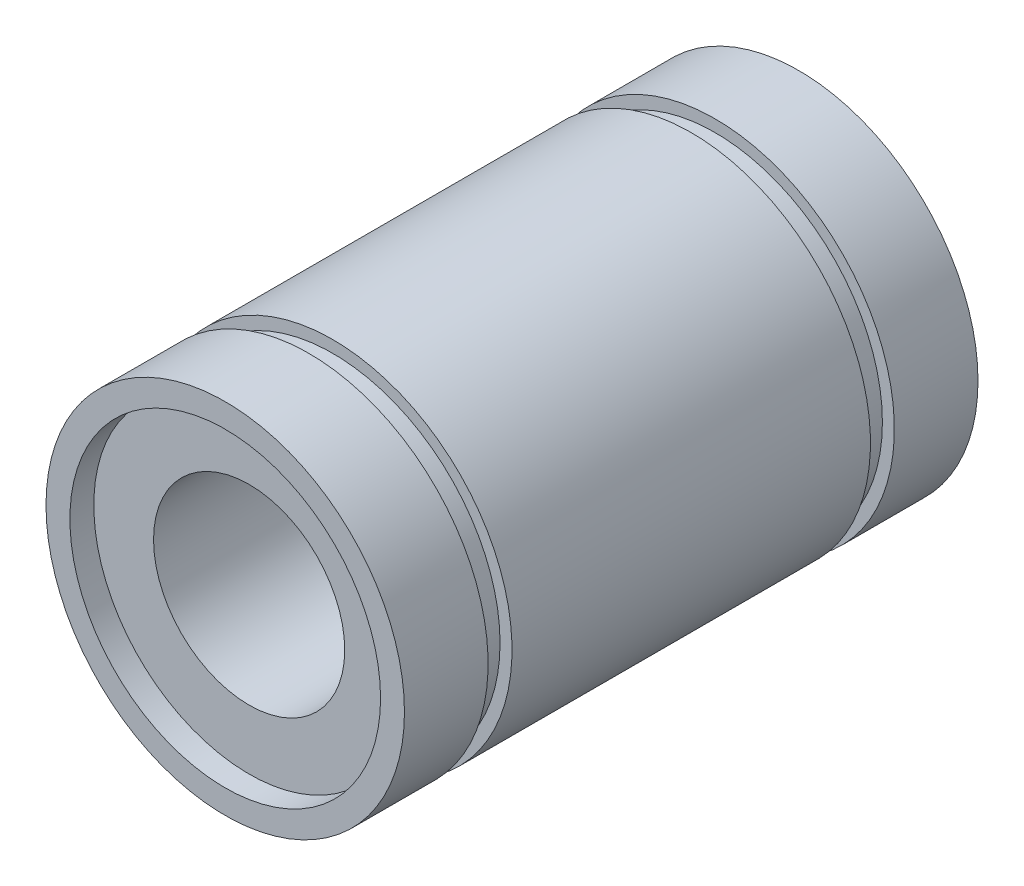
ISO-10303-21;
HEADER;
FILE_DESCRIPTION(('STEP AP214'),'2;1');
FILE_NAME('part.step','',(''),(''),'','','');
FILE_SCHEMA(('AUTOMOTIVE_DESIGN { 1 0 10303 214 1 1 1 1 }'));
ENDSEC;
DATA;
#1=APPLICATION_CONTEXT('core data for automotive mechanical design processes');
#2=APPLICATION_PROTOCOL_DEFINITION('international standard','automotive_design',2000,#1);
#3=PRODUCT_CONTEXT('',#1,'mechanical');
#4=PRODUCT('Part','Part','',(#3));
#5=PRODUCT_RELATED_PRODUCT_CATEGORY('part','',(#4));
#6=PRODUCT_DEFINITION_FORMATION('','',#4);
#7=PRODUCT_DEFINITION_CONTEXT('part definition',#1,'design');
#8=PRODUCT_DEFINITION('design','',#6,#7);
#9=PRODUCT_DEFINITION_SHAPE('','',#8);
#10=(LENGTH_UNIT() NAMED_UNIT(*) SI_UNIT(.MILLI.,.METRE.));
#11=(NAMED_UNIT(*) PLANE_ANGLE_UNIT() SI_UNIT($,.RADIAN.));
#12=(NAMED_UNIT(*) SI_UNIT($,.STERADIAN.) SOLID_ANGLE_UNIT());
#13=UNCERTAINTY_MEASURE_WITH_UNIT(LENGTH_MEASURE(1.E-05),#10,'distance_accuracy_value','');
#14=(GEOMETRIC_REPRESENTATION_CONTEXT(3) GLOBAL_UNCERTAINTY_ASSIGNED_CONTEXT((#13)) GLOBAL_UNIT_ASSIGNED_CONTEXT((#10,
#11,#12)) REPRESENTATION_CONTEXT('',''));
#15=CARTESIAN_POINT('',(0.,0.,0.));
#16=DIRECTION('',(0.,0.,1.));
#17=DIRECTION('',(1.,0.,0.));
#18=AXIS2_PLACEMENT_3D('',#15,#16,#17);
#19=CARTESIAN_POINT('',(0.,0.,11.));
#20=DIRECTION('',(0.,0.,1.));
#21=DIRECTION('',(1.,0.,0.));
#22=AXIS2_PLACEMENT_3D('',#19,#20,#21);
#23=PLANE('',#22);
#24=CARTESIAN_POINT('',(0.,0.,11.));
#25=DIRECTION('',(0.,0.,1.));
#26=DIRECTION('',(1.,0.,0.));
#27=AXIS2_PLACEMENT_3D('',#24,#25,#26);
#28=CIRCLE('',#27,6.5);
#29=CARTESIAN_POINT('',(6.5,0.,11.));
#30=VERTEX_POINT('',#29);
#31=EDGE_CURVE('E11',#30,#30,#28,.T.);
#32=ORIENTED_EDGE('',*,*,#31,.T.);
#33=EDGE_LOOP('',(#32));
#34=FACE_BOUND('',#33,.T.);
#35=CARTESIAN_POINT('',(0.,0.,11.));
#36=DIRECTION('',(0.,0.,1.));
#37=DIRECTION('',(1.,0.,0.));
#38=AXIS2_PLACEMENT_3D('',#35,#36,#37);
#39=CIRCLE('',#38,4.);
#40=CARTESIAN_POINT('',(4.,0.,11.));
#41=VERTEX_POINT('',#40);
#42=EDGE_CURVE('E58',#41,#41,#39,.T.);
#43=ORIENTED_EDGE('',*,*,#42,.F.);
#44=EDGE_LOOP('',(#43));
#45=FACE_BOUND('',#44,.T.);
#46=ADVANCED_FACE('F45',(#34,#45),#23,.T.);
#47=CARTESIAN_POINT('',(0.,0.,-11.));
#48=DIRECTION('',(0.,0.,1.));
#49=DIRECTION('',(1.,0.,0.));
#50=AXIS2_PLACEMENT_3D('',#47,#48,#49);
#51=PLANE('',#50);
#52=CARTESIAN_POINT('',(0.,0.,-11.));
#53=DIRECTION('',(0.,0.,1.));
#54=DIRECTION('',(1.,0.,0.));
#55=AXIS2_PLACEMENT_3D('',#52,#53,#54);
#56=CIRCLE('',#55,6.5);
#57=CARTESIAN_POINT('',(6.5,0.,-11.));
#58=VERTEX_POINT('',#57);
#59=EDGE_CURVE('E49',#58,#58,#56,.T.);
#60=ORIENTED_EDGE('',*,*,#59,.F.);
#61=EDGE_LOOP('',(#60));
#62=FACE_BOUND('',#61,.T.);
#63=CARTESIAN_POINT('',(0.,0.,-11.));
#64=DIRECTION('',(0.,0.,1.));
#65=DIRECTION('',(1.,0.,0.));
#66=AXIS2_PLACEMENT_3D('',#63,#64,#65);
#67=CIRCLE('',#66,4.);
#68=CARTESIAN_POINT('',(4.,0.,-11.));
#69=VERTEX_POINT('',#68);
#70=EDGE_CURVE('E60',#69,#69,#67,.T.);
#71=ORIENTED_EDGE('',*,*,#70,.T.);
#72=EDGE_LOOP('',(#71));
#73=FACE_BOUND('',#72,.T.);
#74=ADVANCED_FACE('F72',(#62,#73),#51,.F.);
#75=CARTESIAN_POINT('',(0.,0.,11.));
#76=DIRECTION('',(0.,0.,-1.));
#77=DIRECTION('',(-1.,0.,0.));
#78=AXIS2_PLACEMENT_3D('',#75,#76,#77);
#79=CYLINDRICAL_SURFACE('',#78,6.5);
#80=ORIENTED_EDGE('',*,*,#31,.F.);
#81=EDGE_LOOP('',(#80));
#82=FACE_BOUND('',#81,.T.);
#83=ORIENTED_EDGE('',*,*,#59,.T.);
#84=EDGE_LOOP('',(#83));
#85=FACE_BOUND('',#84,.T.);
#86=ADVANCED_FACE('F47',(#82,#85),#79,.T.);
#87=CARTESIAN_POINT('',(0.,0.,11.));
#88=DIRECTION('',(0.,0.,-1.));
#89=DIRECTION('',(-1.,0.,0.));
#90=AXIS2_PLACEMENT_3D('',#87,#88,#89);
#91=CYLINDRICAL_SURFACE('',#90,4.);
#92=ORIENTED_EDGE('',*,*,#42,.T.);
#93=EDGE_LOOP('',(#92));
#94=FACE_BOUND('',#93,.T.);
#95=ORIENTED_EDGE('',*,*,#70,.F.);
#96=EDGE_LOOP('',(#95));
#97=FACE_BOUND('',#96,.T.);
#98=ADVANCED_FACE('F68',(#94,#97),#91,.F.);
#99=CLOSED_SHELL('',(#46,#74,#86,#98));
#100=MANIFOLD_SOLID_BREP('B2',#99);
#101=CARTESIAN_POINT('',(0.,0.,12.));
#102=DIRECTION('',(0.,0.,-1.));
#103=DIRECTION('',(-1.,0.,0.));
#104=AXIS2_PLACEMENT_3D('',#101,#102,#103);
#105=CYLINDRICAL_SURFACE('',#104,7.5);
#106=CARTESIAN_POINT('',(0.,0.,12.));
#107=DIRECTION('',(0.,0.,1.));
#108=DIRECTION('',(1.,0.,0.));
#109=AXIS2_PLACEMENT_3D('',#106,#107,#108);
#110=CIRCLE('',#109,7.5);
#111=CARTESIAN_POINT('',(7.5,0.,12.));
#112=VERTEX_POINT('',#111);
#113=EDGE_CURVE('E44',#112,#112,#110,.T.);
#114=ORIENTED_EDGE('',*,*,#113,.F.);
#115=EDGE_LOOP('',(#114));
#116=FACE_BOUND('',#115,.T.);
#117=CARTESIAN_POINT('',(0.,0.,8.5));
#118=DIRECTION('',(0.,0.,-1.));
#119=DIRECTION('',(-1.,0.,0.));
#120=AXIS2_PLACEMENT_3D('',#117,#118,#119);
#121=CIRCLE('',#120,7.5);
#122=CARTESIAN_POINT('',(-7.5,0.,8.5));
#123=VERTEX_POINT('',#122);
#124=EDGE_CURVE('E149',#123,#123,#121,.T.);
#125=ORIENTED_EDGE('',*,*,#124,.F.);
#126=EDGE_LOOP('',(#125));
#127=FACE_BOUND('',#126,.T.);
#128=ADVANCED_FACE('F111',(#116,#127),#105,.T.);
#129=CARTESIAN_POINT('',(0.,0.,-7.5));
#130=DIRECTION('',(0.,0.,-1.));
#131=DIRECTION('',(-1.,0.,0.));
#132=AXIS2_PLACEMENT_3D('',#129,#130,#131);
#133=CIRCLE('',#132,7.5);
#134=CARTESIAN_POINT('',(-7.5,0.,-7.5));
#135=VERTEX_POINT('',#134);
#136=EDGE_CURVE('E126',#135,#135,#133,.T.);
#137=ORIENTED_EDGE('',*,*,#136,.F.);
#138=EDGE_LOOP('',(#137));
#139=FACE_BOUND('',#138,.T.);
#140=CARTESIAN_POINT('',(0.,0.,7.5));
#141=DIRECTION('',(0.,0.,-1.));
#142=DIRECTION('',(-1.,0.,0.));
#143=AXIS2_PLACEMENT_3D('',#140,#141,#142);
#144=CIRCLE('',#143,7.5);
#145=CARTESIAN_POINT('',(-7.5,0.,7.5));
#146=VERTEX_POINT('',#145);
#147=EDGE_CURVE('E146',#146,#146,#144,.T.);
#148=ORIENTED_EDGE('',*,*,#147,.T.);
#149=EDGE_LOOP('',(#148));
#150=FACE_BOUND('',#149,.T.);
#151=ADVANCED_FACE('F157',(#139,#150),#105,.T.);
#152=CARTESIAN_POINT('',(0.,0.,-12.));
#153=DIRECTION('',(0.,0.,1.));
#154=DIRECTION('',(1.,0.,0.));
#155=AXIS2_PLACEMENT_3D('',#152,#153,#154);
#156=CIRCLE('',#155,7.5);
#157=CARTESIAN_POINT('',(7.5,0.,-12.));
#158=VERTEX_POINT('',#157);
#159=EDGE_CURVE('E114',#158,#158,#156,.T.);
#160=ORIENTED_EDGE('',*,*,#159,.T.);
#161=EDGE_LOOP('',(#160));
#162=FACE_BOUND('',#161,.T.);
#163=CARTESIAN_POINT('',(0.,0.,-8.5));
#164=DIRECTION('',(0.,0.,-1.));
#165=DIRECTION('',(-1.,0.,0.));
#166=AXIS2_PLACEMENT_3D('',#163,#164,#165);
#167=CIRCLE('',#166,7.5);
#168=CARTESIAN_POINT('',(-7.5,0.,-8.5));
#169=VERTEX_POINT('',#168);
#170=EDGE_CURVE('E137',#169,#169,#167,.T.);
#171=ORIENTED_EDGE('',*,*,#170,.T.);
#172=EDGE_LOOP('',(#171));
#173=FACE_BOUND('',#172,.T.);
#174=ADVANCED_FACE('F159',(#162,#173),#105,.T.);
#175=CARTESIAN_POINT('',(0.,0.,12.));
#176=DIRECTION('',(0.,0.,1.));
#177=DIRECTION('',(1.,0.,0.));
#178=AXIS2_PLACEMENT_3D('',#175,#176,#177);
#179=PLANE('',#178);
#180=ORIENTED_EDGE('',*,*,#113,.T.);
#181=EDGE_LOOP('',(#180));
#182=FACE_BOUND('',#181,.T.);
#183=CARTESIAN_POINT('',(0.,0.,12.));
#184=DIRECTION('',(0.,0.,1.));
#185=DIRECTION('',(1.,0.,0.));
#186=AXIS2_PLACEMENT_3D('',#183,#184,#185);
#187=CIRCLE('',#186,6.5);
#188=CARTESIAN_POINT('',(6.5,0.,12.));
#189=VERTEX_POINT('',#188);
#190=EDGE_CURVE('E121',#189,#189,#187,.T.);
#191=ORIENTED_EDGE('',*,*,#190,.F.);
#192=EDGE_LOOP('',(#191));
#193=FACE_BOUND('',#192,.T.);
#194=ADVANCED_FACE('F165',(#182,#193),#179,.T.);
#195=CARTESIAN_POINT('',(0.,0.,-12.));
#196=DIRECTION('',(0.,0.,1.));
#197=DIRECTION('',(1.,0.,0.));
#198=AXIS2_PLACEMENT_3D('',#195,#196,#197);
#199=PLANE('',#198);
#200=ORIENTED_EDGE('',*,*,#159,.F.);
#201=EDGE_LOOP('',(#200));
#202=FACE_BOUND('',#201,.T.);
#203=CARTESIAN_POINT('',(0.,0.,-12.));
#204=DIRECTION('',(0.,0.,1.));
#205=DIRECTION('',(1.,0.,0.));
#206=AXIS2_PLACEMENT_3D('',#203,#204,#205);
#207=CIRCLE('',#206,6.5);
#208=CARTESIAN_POINT('',(6.5,0.,-12.));
#209=VERTEX_POINT('',#208);
#210=EDGE_CURVE('E123',#209,#209,#207,.T.);
#211=ORIENTED_EDGE('',*,*,#210,.T.);
#212=EDGE_LOOP('',(#211));
#213=FACE_BOUND('',#212,.T.);
#214=ADVANCED_FACE('F170',(#202,#213),#199,.F.);
#215=CARTESIAN_POINT('',(0.,0.,12.));
#216=DIRECTION('',(0.,0.,-1.));
#217=DIRECTION('',(-1.,0.,0.));
#218=AXIS2_PLACEMENT_3D('',#215,#216,#217);
#219=CYLINDRICAL_SURFACE('',#218,6.5);
#220=ORIENTED_EDGE('',*,*,#190,.T.);
#221=EDGE_LOOP('',(#220));
#222=FACE_BOUND('',#221,.T.);
#223=ORIENTED_EDGE('',*,*,#210,.F.);
#224=EDGE_LOOP('',(#223));
#225=FACE_BOUND('',#224,.T.);
#226=ADVANCED_FACE('F194',(#222,#225),#219,.F.);
#227=CARTESIAN_POINT('',(7.5,0.,-7.5));
#228=DIRECTION('',(0.,0.,-1.));
#229=DIRECTION('',(-1.,0.,0.));
#230=AXIS2_PLACEMENT_3D('',#227,#228,#229);
#231=PLANE('',#230);
#232=ORIENTED_EDGE('',*,*,#136,.T.);
#233=EDGE_LOOP('',(#232));
#234=FACE_BOUND('',#233,.T.);
#235=CARTESIAN_POINT('',(0.,0.,-7.5));
#236=DIRECTION('',(0.,0.,-1.));
#237=DIRECTION('',(-1.,0.,0.));
#238=AXIS2_PLACEMENT_3D('',#235,#236,#237);
#239=CIRCLE('',#238,7.);
#240=CARTESIAN_POINT('',(-7.,0.,-7.5));
#241=VERTEX_POINT('',#240);
#242=EDGE_CURVE('E131',#241,#241,#239,.T.);
#243=ORIENTED_EDGE('',*,*,#242,.F.);
#244=EDGE_LOOP('',(#243));
#245=FACE_BOUND('',#244,.T.);
#246=ADVANCED_FACE('F187',(#234,#245),#231,.T.);
#247=CARTESIAN_POINT('',(0.,0.,-12.));
#248=DIRECTION('',(0.,0.,-1.));
#249=DIRECTION('',(-1.,0.,0.));
#250=AXIS2_PLACEMENT_3D('',#247,#248,#249);
#251=CYLINDRICAL_SURFACE('',#250,7.);
#252=ORIENTED_EDGE('',*,*,#242,.T.);
#253=EDGE_LOOP('',(#252));
#254=FACE_BOUND('',#253,.T.);
#255=CARTESIAN_POINT('',(0.,0.,-8.5));
#256=DIRECTION('',(0.,0.,-1.));
#257=DIRECTION('',(-1.,0.,0.));
#258=AXIS2_PLACEMENT_3D('',#255,#256,#257);
#259=CIRCLE('',#258,7.);
#260=CARTESIAN_POINT('',(-7.,0.,-8.5));
#261=VERTEX_POINT('',#260);
#262=EDGE_CURVE('E134',#261,#261,#259,.T.);
#263=ORIENTED_EDGE('',*,*,#262,.F.);
#264=EDGE_LOOP('',(#263));
#265=FACE_BOUND('',#264,.T.);
#266=ADVANCED_FACE('F178',(#254,#265),#251,.T.);
#267=CARTESIAN_POINT('',(7.5,0.,-8.5));
#268=DIRECTION('',(0.,0.,1.));
#269=DIRECTION('',(1.,0.,0.));
#270=AXIS2_PLACEMENT_3D('',#267,#268,#269);
#271=PLANE('',#270);
#272=ORIENTED_EDGE('',*,*,#262,.T.);
#273=EDGE_LOOP('',(#272));
#274=FACE_BOUND('',#273,.T.);
#275=ORIENTED_EDGE('',*,*,#170,.F.);
#276=EDGE_LOOP('',(#275));
#277=FACE_BOUND('',#276,.T.);
#278=ADVANCED_FACE('F176',(#274,#277),#271,.T.);
#279=CARTESIAN_POINT('',(7.5,0.,8.5));
#280=DIRECTION('',(0.,0.,-1.));
#281=DIRECTION('',(-1.,0.,0.));
#282=AXIS2_PLACEMENT_3D('',#279,#280,#281);
#283=PLANE('',#282);
#284=ORIENTED_EDGE('',*,*,#124,.T.);
#285=EDGE_LOOP('',(#284));
#286=FACE_BOUND('',#285,.T.);
#287=CARTESIAN_POINT('',(0.,0.,8.5));
#288=DIRECTION('',(0.,0.,-1.));
#289=DIRECTION('',(-1.,0.,0.));
#290=AXIS2_PLACEMENT_3D('',#287,#288,#289);
#291=CIRCLE('',#290,7.);
#292=CARTESIAN_POINT('',(-7.,0.,8.5));
#293=VERTEX_POINT('',#292);
#294=EDGE_CURVE('E140',#293,#293,#291,.T.);
#295=ORIENTED_EDGE('',*,*,#294,.F.);
#296=EDGE_LOOP('',(#295));
#297=FACE_BOUND('',#296,.T.);
#298=ADVANCED_FACE('F153',(#286,#297),#283,.T.);
#299=CARTESIAN_POINT('',(0.,0.,-12.));
#300=DIRECTION('',(0.,0.,-1.));
#301=DIRECTION('',(-1.,0.,0.));
#302=AXIS2_PLACEMENT_3D('',#299,#300,#301);
#303=CYLINDRICAL_SURFACE('',#302,7.);
#304=ORIENTED_EDGE('',*,*,#294,.T.);
#305=EDGE_LOOP('',(#304));
#306=FACE_BOUND('',#305,.T.);
#307=CARTESIAN_POINT('',(0.,0.,7.5));
#308=DIRECTION('',(0.,0.,-1.));
#309=DIRECTION('',(-1.,0.,0.));
#310=AXIS2_PLACEMENT_3D('',#307,#308,#309);
#311=CIRCLE('',#310,7.);
#312=CARTESIAN_POINT('',(-7.,0.,7.5));
#313=VERTEX_POINT('',#312);
#314=EDGE_CURVE('E143',#313,#313,#311,.T.);
#315=ORIENTED_EDGE('',*,*,#314,.F.);
#316=EDGE_LOOP('',(#315));
#317=FACE_BOUND('',#316,.T.);
#318=ADVANCED_FACE('F185',(#306,#317),#303,.T.);
#319=CARTESIAN_POINT('',(7.5,0.,7.5));
#320=DIRECTION('',(0.,0.,1.));
#321=DIRECTION('',(1.,0.,0.));
#322=AXIS2_PLACEMENT_3D('',#319,#320,#321);
#323=PLANE('',#322);
#324=ORIENTED_EDGE('',*,*,#314,.T.);
#325=EDGE_LOOP('',(#324));
#326=FACE_BOUND('',#325,.T.);
#327=ORIENTED_EDGE('',*,*,#147,.F.);
#328=EDGE_LOOP('',(#327));
#329=FACE_BOUND('',#328,.T.);
#330=ADVANCED_FACE('F238',(#326,#329),#323,.T.);
#331=CLOSED_SHELL('',(#128,#151,#174,#194,#214,#226,#246,#266,#278,#298,#318,#330));
#332=MANIFOLD_SOLID_BREP('B6',#331);
#333=ADVANCED_BREP_SHAPE_REPRESENTATION('',(#18,#100,#332),#14);
#334=SHAPE_DEFINITION_REPRESENTATION(#9,#333);
ENDSEC;
END-ISO-10303-21;
